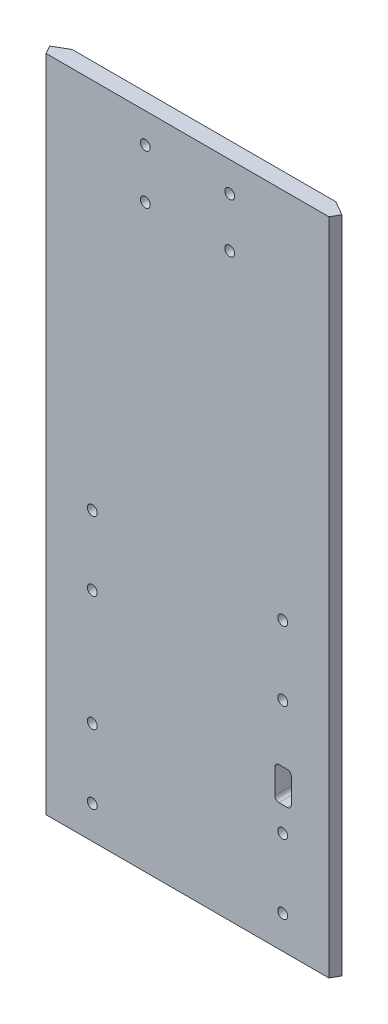
ISO-10303-21;
HEADER;
FILE_DESCRIPTION(('STEP AP214'),'2;1');
FILE_NAME('part.step','',(''),(''),'','','');
FILE_SCHEMA(('AUTOMOTIVE_DESIGN { 1 0 10303 214 1 1 1 1 }'));
ENDSEC;
DATA;
#1=APPLICATION_CONTEXT('core data for automotive mechanical design processes');
#2=APPLICATION_PROTOCOL_DEFINITION('international standard','automotive_design',2000,#1);
#3=PRODUCT_CONTEXT('',#1,'mechanical');
#4=PRODUCT('Part','Part','',(#3));
#5=PRODUCT_RELATED_PRODUCT_CATEGORY('part','',(#4));
#6=PRODUCT_DEFINITION_FORMATION('','',#4);
#7=PRODUCT_DEFINITION_CONTEXT('part definition',#1,'design');
#8=PRODUCT_DEFINITION('design','',#6,#7);
#9=PRODUCT_DEFINITION_SHAPE('','',#8);
#10=(LENGTH_UNIT() NAMED_UNIT(*) SI_UNIT(.MILLI.,.METRE.));
#11=(NAMED_UNIT(*) PLANE_ANGLE_UNIT() SI_UNIT($,.RADIAN.));
#12=(NAMED_UNIT(*) SI_UNIT($,.STERADIAN.) SOLID_ANGLE_UNIT());
#13=UNCERTAINTY_MEASURE_WITH_UNIT(LENGTH_MEASURE(1.E-05),#10,'distance_accuracy_value','');
#14=(GEOMETRIC_REPRESENTATION_CONTEXT(3) GLOBAL_UNCERTAINTY_ASSIGNED_CONTEXT((#13)) GLOBAL_UNIT_ASSIGNED_CONTEXT((#10,
#11,#12)) REPRESENTATION_CONTEXT('',''));
#15=CARTESIAN_POINT('',(0.,0.,0.));
#16=DIRECTION('',(0.,0.,1.));
#17=DIRECTION('',(1.,0.,0.));
#18=AXIS2_PLACEMENT_3D('',#15,#16,#17);
#19=CARTESIAN_POINT('',(-50.8,101.6,6.35));
#20=DIRECTION('',(0.,-1.,0.));
#21=DIRECTION('',(0.,0.,-1.));
#22=AXIS2_PLACEMENT_3D('',#19,#20,#21);
#23=PLANE('',#22);
#24=DIRECTION('',(-0.866025403784442,0.,0.499999999999994));
#25=VECTOR('',#24,1.);
#26=CARTESIAN_POINT('',(-50.8,101.6,0.));
#27=LINE('',#26,#25);
#28=CARTESIAN_POINT('',(-50.8,101.6,0.));
#29=VERTEX_POINT('',#28);
#30=CARTESIAN_POINT('',(-56.2992613140312,101.6,3.17499999999996));
#31=VERTEX_POINT('',#30);
#32=EDGE_CURVE('E331',#29,#31,#27,.T.);
#33=ORIENTED_EDGE('',*,*,#32,.T.);
#34=DIRECTION('',(-0.499999999999999,0.,-0.866025403784439));
#35=VECTOR('',#34,1.);
#36=CARTESIAN_POINT('',(-56.2992613140313,101.6,3.17499999999996));
#37=LINE('',#36,#35);
#38=CARTESIAN_POINT('',(-54.4661742093542,101.6,6.34999999999999));
#39=VERTEX_POINT('',#38);
#40=EDGE_CURVE('E148',#39,#31,#37,.T.);
#41=ORIENTED_EDGE('',*,*,#40,.F.);
#42=DIRECTION('',(-1.,0.,0.));
#43=VECTOR('',#42,1.);
#44=CARTESIAN_POINT('',(-50.8,101.6,6.35));
#45=LINE('',#44,#43);
#46=CARTESIAN_POINT('',(54.4661742093542,101.6,6.34999999999999));
#47=VERTEX_POINT('',#46);
#48=EDGE_CURVE('E157',#47,#39,#45,.T.);
#49=ORIENTED_EDGE('',*,*,#48,.F.);
#50=DIRECTION('',(-0.499999999999999,0.,0.866025403784439));
#51=VECTOR('',#50,1.);
#52=CARTESIAN_POINT('',(56.2992613140313,101.6,3.17499999999996));
#53=LINE('',#52,#51);
#54=CARTESIAN_POINT('',(56.2992613140313,101.6,3.17499999999996));
#55=VERTEX_POINT('',#54);
#56=EDGE_CURVE('E320',#55,#47,#53,.T.);
#57=ORIENTED_EDGE('',*,*,#56,.F.);
#58=DIRECTION('',(-0.866025403784442,0.,-0.499999999999995));
#59=VECTOR('',#58,1.);
#60=CARTESIAN_POINT('',(50.8,101.6,0.));
#61=LINE('',#60,#59);
#62=CARTESIAN_POINT('',(50.8,101.6,0.));
#63=VERTEX_POINT('',#62);
#64=EDGE_CURVE('E327',#55,#63,#61,.T.);
#65=ORIENTED_EDGE('',*,*,#64,.T.);
#66=DIRECTION('',(-1.,0.,0.));
#67=VECTOR('',#66,1.);
#68=CARTESIAN_POINT('',(-50.8,101.6,0.));
#69=LINE('',#68,#67);
#70=EDGE_CURVE('E174',#63,#29,#69,.T.);
#71=ORIENTED_EDGE('',*,*,#70,.T.);
#72=EDGE_LOOP('',(#33,#41,#49,#57,#65,#71));
#73=FACE_BOUND('',#72,.T.);
#74=ADVANCED_FACE('F37',(#73),#23,.F.);
#75=CARTESIAN_POINT('',(-50.8,-152.4,6.35));
#76=DIRECTION('',(0.,1.,0.));
#77=DIRECTION('',(0.,0.,1.));
#78=AXIS2_PLACEMENT_3D('',#75,#76,#77);
#79=PLANE('',#78);
#80=DIRECTION('',(1.,0.,0.));
#81=VECTOR('',#80,1.);
#82=CARTESIAN_POINT('',(-50.8,-152.4,6.35));
#83=LINE('',#82,#81);
#84=CARTESIAN_POINT('',(-54.4661742093542,-152.4,6.34999999999999));
#85=VERTEX_POINT('',#84);
#86=CARTESIAN_POINT('',(54.4661742093542,-152.4,6.34999999999999));
#87=VERTEX_POINT('',#86);
#88=EDGE_CURVE('E154',#85,#87,#83,.T.);
#89=ORIENTED_EDGE('',*,*,#88,.F.);
#90=DIRECTION('',(-0.499999999999999,0.,-0.866025403784439));
#91=VECTOR('',#90,1.);
#92=CARTESIAN_POINT('',(-56.2992613140313,-152.4,3.17499999999996));
#93=LINE('',#92,#91);
#94=CARTESIAN_POINT('',(-56.2992613140313,-152.4,3.17499999999996));
#95=VERTEX_POINT('',#94);
#96=EDGE_CURVE('E138',#85,#95,#93,.T.);
#97=ORIENTED_EDGE('',*,*,#96,.T.);
#98=DIRECTION('',(0.866025403784442,0.,-0.499999999999994));
#99=VECTOR('',#98,1.);
#100=CARTESIAN_POINT('',(-50.8,-152.4,0.));
#101=LINE('',#100,#99);
#102=CARTESIAN_POINT('',(-50.8,-152.4,0.));
#103=VERTEX_POINT('',#102);
#104=EDGE_CURVE('E175',#95,#103,#101,.T.);
#105=ORIENTED_EDGE('',*,*,#104,.T.);
#106=DIRECTION('',(1.,0.,0.));
#107=VECTOR('',#106,1.);
#108=CARTESIAN_POINT('',(-50.8,-152.4,0.));
#109=LINE('',#108,#107);
#110=CARTESIAN_POINT('',(50.8,-152.4,0.));
#111=VERTEX_POINT('',#110);
#112=EDGE_CURVE('E167',#103,#111,#109,.T.);
#113=ORIENTED_EDGE('',*,*,#112,.T.);
#114=DIRECTION('',(0.866025403784442,0.,0.499999999999995));
#115=VECTOR('',#114,1.);
#116=CARTESIAN_POINT('',(50.8,-152.4,0.));
#117=LINE('',#116,#115);
#118=CARTESIAN_POINT('',(56.2992613140312,-152.4,3.17499999999996));
#119=VERTEX_POINT('',#118);
#120=EDGE_CURVE('E329',#111,#119,#117,.T.);
#121=ORIENTED_EDGE('',*,*,#120,.T.);
#122=DIRECTION('',(-0.499999999999999,0.,0.866025403784439));
#123=VECTOR('',#122,1.);
#124=CARTESIAN_POINT('',(56.2992613140313,-152.4,3.17499999999996));
#125=LINE('',#124,#123);
#126=EDGE_CURVE('E162',#119,#87,#125,.T.);
#127=ORIENTED_EDGE('',*,*,#126,.T.);
#128=EDGE_LOOP('',(#89,#97,#105,#113,#121,#127));
#129=FACE_BOUND('',#128,.T.);
#130=ADVANCED_FACE('F160',(#129),#79,.F.);
#131=CARTESIAN_POINT('',(0.,0.,6.35));
#132=DIRECTION('',(0.,0.,1.));
#133=DIRECTION('',(1.,0.,0.));
#134=AXIS2_PLACEMENT_3D('',#131,#132,#133);
#135=PLANE('',#134);
#136=DIRECTION('',(-1.,0.,0.));
#137=VECTOR('',#136,1.);
#138=CARTESIAN_POINT('',(33.6381742093542,-90.8050000000001,6.35));
#139=LINE('',#138,#137);
#140=CARTESIAN_POINT('',(38.4006742093542,-90.805,6.35));
#141=VERTEX_POINT('',#140);
#142=CARTESIAN_POINT('',(35.2256742093542,-90.8050000000001,6.35));
#143=VERTEX_POINT('',#142);
#144=EDGE_CURVE('E213',#141,#143,#139,.T.);
#145=ORIENTED_EDGE('',*,*,#144,.F.);
#146=CARTESIAN_POINT('',(38.4006742093542,-92.3925000000001,6.35));
#147=DIRECTION('',(0.,0.,1.));
#148=DIRECTION('',(1.,0.,0.));
#149=AXIS2_PLACEMENT_3D('',#146,#147,#148);
#150=CIRCLE('',#149,1.5875);
#151=CARTESIAN_POINT('',(39.9881742093542,-92.3925000000001,6.35));
#152=VERTEX_POINT('',#151);
#153=EDGE_CURVE('E207',#141,#152,#150,.F.);
#154=ORIENTED_EDGE('',*,*,#153,.T.);
#155=DIRECTION('',(0.,1.,0.));
#156=VECTOR('',#155,1.);
#157=CARTESIAN_POINT('',(39.9881742093542,-103.505,6.35));
#158=LINE('',#157,#156);
#159=CARTESIAN_POINT('',(39.9881742093542,-101.9175,6.35));
#160=VERTEX_POINT('',#159);
#161=EDGE_CURVE('E237',#160,#152,#158,.T.);
#162=ORIENTED_EDGE('',*,*,#161,.F.);
#163=CARTESIAN_POINT('',(38.4006742093542,-101.9175,6.35));
#164=DIRECTION('',(0.,0.,1.));
#165=DIRECTION('',(1.,0.,0.));
#166=AXIS2_PLACEMENT_3D('',#163,#164,#165);
#167=CIRCLE('',#166,1.5875);
#168=CARTESIAN_POINT('',(38.4006742093542,-103.505,6.35));
#169=VERTEX_POINT('',#168);
#170=EDGE_CURVE('E199',#160,#169,#167,.F.);
#171=ORIENTED_EDGE('',*,*,#170,.T.);
#172=DIRECTION('',(1.,0.,0.));
#173=VECTOR('',#172,1.);
#174=CARTESIAN_POINT('',(33.6381742093542,-103.505,6.35));
#175=LINE('',#174,#173);
#176=CARTESIAN_POINT('',(35.2256742093542,-103.505,6.35));
#177=VERTEX_POINT('',#176);
#178=EDGE_CURVE('E243',#177,#169,#175,.T.);
#179=ORIENTED_EDGE('',*,*,#178,.F.);
#180=CARTESIAN_POINT('',(35.2256742093542,-101.9175,6.35));
#181=DIRECTION('',(0.,0.,1.));
#182=DIRECTION('',(1.,0.,0.));
#183=AXIS2_PLACEMENT_3D('',#180,#181,#182);
#184=CIRCLE('',#183,1.5875);
#185=CARTESIAN_POINT('',(33.6381742093542,-101.9175,6.35));
#186=VERTEX_POINT('',#185);
#187=EDGE_CURVE('E203',#177,#186,#184,.F.);
#188=ORIENTED_EDGE('',*,*,#187,.T.);
#189=DIRECTION('',(0.,-1.,0.));
#190=VECTOR('',#189,1.);
#191=CARTESIAN_POINT('',(33.6381742093542,-90.8050000000001,6.35));
#192=LINE('',#191,#190);
#193=CARTESIAN_POINT('',(33.6381742093542,-92.3925000000001,6.35));
#194=VERTEX_POINT('',#193);
#195=EDGE_CURVE('E215',#194,#186,#192,.T.);
#196=ORIENTED_EDGE('',*,*,#195,.F.);
#197=CARTESIAN_POINT('',(35.2256742093542,-92.3925000000001,6.35));
#198=DIRECTION('',(0.,0.,1.));
#199=DIRECTION('',(1.,0.,0.));
#200=AXIS2_PLACEMENT_3D('',#197,#198,#199);
#201=CIRCLE('',#200,1.5875);
#202=EDGE_CURVE('E45',#194,#143,#201,.F.);
#203=ORIENTED_EDGE('',*,*,#202,.T.);
#204=EDGE_LOOP('',(#145,#154,#162,#171,#179,#188,#196,#203));
#205=FACE_BOUND('',#204,.T.);
#206=CARTESIAN_POINT('',(-16.256,71.12,6.35));
#207=DIRECTION('',(0.,0.,1.));
#208=DIRECTION('',(1.,0.,0.));
#209=AXIS2_PLACEMENT_3D('',#206,#207,#208);
#210=CIRCLE('',#209,1.905);
#211=CARTESIAN_POINT('',(-14.351,71.12,6.35));
#212=VERTEX_POINT('',#211);
#213=EDGE_CURVE('E240',#212,#212,#210,.T.);
#214=ORIENTED_EDGE('',*,*,#213,.F.);
#215=EDGE_LOOP('',(#214));
#216=FACE_BOUND('',#215,.T.);
#217=CARTESIAN_POINT('',(16.256,71.12,6.35));
#218=DIRECTION('',(0.,0.,1.));
#219=DIRECTION('',(1.,0.,0.));
#220=AXIS2_PLACEMENT_3D('',#217,#218,#219);
#221=CIRCLE('',#220,1.905);
#222=CARTESIAN_POINT('',(18.161,71.12,6.35));
#223=VERTEX_POINT('',#222);
#224=EDGE_CURVE('E251',#223,#223,#221,.T.);
#225=ORIENTED_EDGE('',*,*,#224,.F.);
#226=EDGE_LOOP('',(#225));
#227=FACE_BOUND('',#226,.T.);
#228=CARTESIAN_POINT('',(16.256,90.17,6.35));
#229=DIRECTION('',(0.,0.,1.));
#230=DIRECTION('',(1.,0.,0.));
#231=AXIS2_PLACEMENT_3D('',#228,#229,#230);
#232=CIRCLE('',#231,1.905);
#233=CARTESIAN_POINT('',(18.161,90.17,6.35));
#234=VERTEX_POINT('',#233);
#235=EDGE_CURVE('E257',#234,#234,#232,.T.);
#236=ORIENTED_EDGE('',*,*,#235,.F.);
#237=EDGE_LOOP('',(#236));
#238=FACE_BOUND('',#237,.T.);
#239=CARTESIAN_POINT('',(-16.256,90.17,6.35));
#240=DIRECTION('',(0.,0.,1.));
#241=DIRECTION('',(1.,0.,0.));
#242=AXIS2_PLACEMENT_3D('',#239,#240,#241);
#243=CIRCLE('',#242,1.905);
#244=CARTESIAN_POINT('',(-14.351,90.17,6.35));
#245=VERTEX_POINT('',#244);
#246=EDGE_CURVE('E263',#245,#245,#243,.T.);
#247=ORIENTED_EDGE('',*,*,#246,.F.);
#248=EDGE_LOOP('',(#247));
#249=FACE_BOUND('',#248,.T.);
#250=CARTESIAN_POINT('',(-36.6861742093542,-68.58,6.35));
#251=DIRECTION('',(0.,0.,1.));
#252=DIRECTION('',(1.,0.,0.));
#253=AXIS2_PLACEMENT_3D('',#250,#251,#252);
#254=CIRCLE('',#253,1.905);
#255=CARTESIAN_POINT('',(-34.7811742093542,-68.58,6.35));
#256=VERTEX_POINT('',#255);
#257=EDGE_CURVE('E269',#256,#256,#254,.T.);
#258=ORIENTED_EDGE('',*,*,#257,.F.);
#259=EDGE_LOOP('',(#258));
#260=FACE_BOUND('',#259,.T.);
#261=CARTESIAN_POINT('',(-36.6861742093542,-113.03,6.35));
#262=DIRECTION('',(0.,0.,1.));
#263=DIRECTION('',(1.,0.,0.));
#264=AXIS2_PLACEMENT_3D('',#261,#262,#263);
#265=CIRCLE('',#264,1.905);
#266=CARTESIAN_POINT('',(-34.7811742093542,-113.03,6.35));
#267=VERTEX_POINT('',#266);
#268=EDGE_CURVE('E275',#267,#267,#265,.T.);
#269=ORIENTED_EDGE('',*,*,#268,.F.);
#270=EDGE_LOOP('',(#269));
#271=FACE_BOUND('',#270,.T.);
#272=CARTESIAN_POINT('',(-36.6861742093542,-139.7,6.35));
#273=DIRECTION('',(0.,0.,1.));
#274=DIRECTION('',(1.,0.,0.));
#275=AXIS2_PLACEMENT_3D('',#272,#273,#274);
#276=CIRCLE('',#275,1.905);
#277=CARTESIAN_POINT('',(-34.7811742093542,-139.7,6.35));
#278=VERTEX_POINT('',#277);
#279=EDGE_CURVE('E281',#278,#278,#276,.T.);
#280=ORIENTED_EDGE('',*,*,#279,.F.);
#281=EDGE_LOOP('',(#280));
#282=FACE_BOUND('',#281,.T.);
#283=CARTESIAN_POINT('',(36.6861742093542,-139.7,6.35));
#284=DIRECTION('',(0.,0.,1.));
#285=DIRECTION('',(1.,0.,0.));
#286=AXIS2_PLACEMENT_3D('',#283,#284,#285);
#287=CIRCLE('',#286,1.905);
#288=CARTESIAN_POINT('',(38.5911742093542,-139.7,6.35));
#289=VERTEX_POINT('',#288);
#290=EDGE_CURVE('E287',#289,#289,#287,.T.);
#291=ORIENTED_EDGE('',*,*,#290,.F.);
#292=EDGE_LOOP('',(#291));
#293=FACE_BOUND('',#292,.T.);
#294=CARTESIAN_POINT('',(36.6861742093542,-113.03,6.35));
#295=DIRECTION('',(0.,0.,1.));
#296=DIRECTION('',(1.,0.,0.));
#297=AXIS2_PLACEMENT_3D('',#294,#295,#296);
#298=CIRCLE('',#297,1.905);
#299=CARTESIAN_POINT('',(38.5911742093542,-113.03,6.35));
#300=VERTEX_POINT('',#299);
#301=EDGE_CURVE('E293',#300,#300,#298,.T.);
#302=ORIENTED_EDGE('',*,*,#301,.F.);
#303=EDGE_LOOP('',(#302));
#304=FACE_BOUND('',#303,.T.);
#305=CARTESIAN_POINT('',(36.6861742093542,-68.58,6.35));
#306=DIRECTION('',(0.,0.,1.));
#307=DIRECTION('',(1.,0.,0.));
#308=AXIS2_PLACEMENT_3D('',#305,#306,#307);
#309=CIRCLE('',#308,1.905);
#310=CARTESIAN_POINT('',(38.5911742093542,-68.58,6.35));
#311=VERTEX_POINT('',#310);
#312=EDGE_CURVE('E299',#311,#311,#309,.T.);
#313=ORIENTED_EDGE('',*,*,#312,.F.);
#314=EDGE_LOOP('',(#313));
#315=FACE_BOUND('',#314,.T.);
#316=CARTESIAN_POINT('',(36.6861742093542,-41.91,6.35));
#317=DIRECTION('',(0.,0.,1.));
#318=DIRECTION('',(1.,0.,0.));
#319=AXIS2_PLACEMENT_3D('',#316,#317,#318);
#320=CIRCLE('',#319,1.905);
#321=CARTESIAN_POINT('',(38.5911742093542,-41.91,6.35));
#322=VERTEX_POINT('',#321);
#323=EDGE_CURVE('E305',#322,#322,#320,.T.);
#324=ORIENTED_EDGE('',*,*,#323,.F.);
#325=EDGE_LOOP('',(#324));
#326=FACE_BOUND('',#325,.T.);
#327=CARTESIAN_POINT('',(-36.6861742093542,-41.91,6.35));
#328=DIRECTION('',(0.,0.,1.));
#329=DIRECTION('',(1.,0.,0.));
#330=AXIS2_PLACEMENT_3D('',#327,#328,#329);
#331=CIRCLE('',#330,1.905);
#332=CARTESIAN_POINT('',(-34.7811742093542,-41.91,6.35));
#333=VERTEX_POINT('',#332);
#334=EDGE_CURVE('E311',#333,#333,#331,.T.);
#335=ORIENTED_EDGE('',*,*,#334,.F.);
#336=EDGE_LOOP('',(#335));
#337=FACE_BOUND('',#336,.T.);
#338=DIRECTION('',(0.,1.,0.));
#339=VECTOR('',#338,1.);
#340=CARTESIAN_POINT('',(-54.4661742093542,-152.4,6.34999999999999));
#341=LINE('',#340,#339);
#342=EDGE_CURVE('E141',#85,#39,#341,.T.);
#343=ORIENTED_EDGE('',*,*,#342,.F.);
#344=ORIENTED_EDGE('',*,*,#88,.T.);
#345=DIRECTION('',(0.,1.,0.));
#346=VECTOR('',#345,1.);
#347=CARTESIAN_POINT('',(54.4661742093542,-152.4,6.34999999999999));
#348=LINE('',#347,#346);
#349=EDGE_CURVE('E325',#87,#47,#348,.T.);
#350=ORIENTED_EDGE('',*,*,#349,.T.);
#351=ORIENTED_EDGE('',*,*,#48,.T.);
#352=EDGE_LOOP('',(#343,#344,#350,#351));
#353=FACE_BOUND('',#352,.T.);
#354=ADVANCED_FACE('F152',(#205,#216,#227,#238,#249,#260,#271,#282,#293,#304,#315,#326,#337,
#353),#135,.T.);
#355=CARTESIAN_POINT('',(0.,0.,0.));
#356=DIRECTION('',(0.,0.,1.));
#357=DIRECTION('',(1.,0.,0.));
#358=AXIS2_PLACEMENT_3D('',#355,#356,#357);
#359=PLANE('',#358);
#360=DIRECTION('',(1.,0.,0.));
#361=VECTOR('',#360,1.);
#362=CARTESIAN_POINT('',(33.6381742093542,-103.505,0.));
#363=LINE('',#362,#361);
#364=CARTESIAN_POINT('',(35.2256742093542,-103.505,0.));
#365=VERTEX_POINT('',#364);
#366=CARTESIAN_POINT('',(38.4006742093542,-103.505,0.));
#367=VERTEX_POINT('',#366);
#368=EDGE_CURVE('E233',#365,#367,#363,.T.);
#369=ORIENTED_EDGE('',*,*,#368,.T.);
#370=CARTESIAN_POINT('',(38.4006742093542,-101.9175,0.));
#371=DIRECTION('',(0.,0.,1.));
#372=DIRECTION('',(1.,0.,0.));
#373=AXIS2_PLACEMENT_3D('',#370,#371,#372);
#374=CIRCLE('',#373,1.5875);
#375=CARTESIAN_POINT('',(39.9881742093542,-101.9175,0.));
#376=VERTEX_POINT('',#375);
#377=EDGE_CURVE('E201',#367,#376,#374,.T.);
#378=ORIENTED_EDGE('',*,*,#377,.T.);
#379=DIRECTION('',(0.,1.,0.));
#380=VECTOR('',#379,1.);
#381=CARTESIAN_POINT('',(39.9881742093542,-103.505,0.));
#382=LINE('',#381,#380);
#383=CARTESIAN_POINT('',(39.9881742093542,-92.3925000000001,0.));
#384=VERTEX_POINT('',#383);
#385=EDGE_CURVE('E235',#376,#384,#382,.T.);
#386=ORIENTED_EDGE('',*,*,#385,.T.);
#387=CARTESIAN_POINT('',(38.4006742093542,-92.3925000000001,0.));
#388=DIRECTION('',(0.,0.,1.));
#389=DIRECTION('',(1.,0.,0.));
#390=AXIS2_PLACEMENT_3D('',#387,#388,#389);
#391=CIRCLE('',#390,1.5875);
#392=CARTESIAN_POINT('',(38.4006742093542,-90.805,0.));
#393=VERTEX_POINT('',#392);
#394=EDGE_CURVE('E59',#384,#393,#391,.T.);
#395=ORIENTED_EDGE('',*,*,#394,.T.);
#396=DIRECTION('',(-1.,0.,0.));
#397=VECTOR('',#396,1.);
#398=CARTESIAN_POINT('',(33.6381742093542,-90.8050000000001,0.));
#399=LINE('',#398,#397);
#400=CARTESIAN_POINT('',(35.2256742093542,-90.8050000000001,0.));
#401=VERTEX_POINT('',#400);
#402=EDGE_CURVE('E229',#393,#401,#399,.T.);
#403=ORIENTED_EDGE('',*,*,#402,.T.);
#404=CARTESIAN_POINT('',(35.2256742093542,-92.3925000000001,0.));
#405=DIRECTION('',(0.,0.,1.));
#406=DIRECTION('',(1.,0.,0.));
#407=AXIS2_PLACEMENT_3D('',#404,#405,#406);
#408=CIRCLE('',#407,1.5875);
#409=CARTESIAN_POINT('',(33.6381742093542,-92.3925000000001,0.));
#410=VERTEX_POINT('',#409);
#411=EDGE_CURVE('E11',#401,#410,#408,.T.);
#412=ORIENTED_EDGE('',*,*,#411,.T.);
#413=DIRECTION('',(0.,-1.,0.));
#414=VECTOR('',#413,1.);
#415=CARTESIAN_POINT('',(33.6381742093542,-90.8050000000001,0.));
#416=LINE('',#415,#414);
#417=CARTESIAN_POINT('',(33.6381742093542,-101.9175,0.));
#418=VERTEX_POINT('',#417);
#419=EDGE_CURVE('E227',#410,#418,#416,.T.);
#420=ORIENTED_EDGE('',*,*,#419,.T.);
#421=CARTESIAN_POINT('',(35.2256742093542,-101.9175,0.));
#422=DIRECTION('',(0.,0.,1.));
#423=DIRECTION('',(1.,0.,0.));
#424=AXIS2_PLACEMENT_3D('',#421,#422,#423);
#425=CIRCLE('',#424,1.5875);
#426=EDGE_CURVE('E205',#418,#365,#425,.T.);
#427=ORIENTED_EDGE('',*,*,#426,.T.);
#428=EDGE_LOOP('',(#369,#378,#386,#395,#403,#412,#420,#427));
#429=FACE_BOUND('',#428,.T.);
#430=CARTESIAN_POINT('',(-16.256,71.12,0.));
#431=DIRECTION('',(0.,0.,1.));
#432=DIRECTION('',(1.,0.,0.));
#433=AXIS2_PLACEMENT_3D('',#430,#431,#432);
#434=CIRCLE('',#433,1.905);
#435=CARTESIAN_POINT('',(-14.351,71.12,0.));
#436=VERTEX_POINT('',#435);
#437=EDGE_CURVE('E248',#436,#436,#434,.T.);
#438=ORIENTED_EDGE('',*,*,#437,.T.);
#439=EDGE_LOOP('',(#438));
#440=FACE_BOUND('',#439,.T.);
#441=CARTESIAN_POINT('',(16.256,71.12,0.));
#442=DIRECTION('',(0.,0.,1.));
#443=DIRECTION('',(1.,0.,0.));
#444=AXIS2_PLACEMENT_3D('',#441,#442,#443);
#445=CIRCLE('',#444,1.905);
#446=CARTESIAN_POINT('',(18.161,71.12,0.));
#447=VERTEX_POINT('',#446);
#448=EDGE_CURVE('E254',#447,#447,#445,.T.);
#449=ORIENTED_EDGE('',*,*,#448,.T.);
#450=EDGE_LOOP('',(#449));
#451=FACE_BOUND('',#450,.T.);
#452=CARTESIAN_POINT('',(16.256,90.17,0.));
#453=DIRECTION('',(0.,0.,1.));
#454=DIRECTION('',(1.,0.,0.));
#455=AXIS2_PLACEMENT_3D('',#452,#453,#454);
#456=CIRCLE('',#455,1.905);
#457=CARTESIAN_POINT('',(18.161,90.17,0.));
#458=VERTEX_POINT('',#457);
#459=EDGE_CURVE('E260',#458,#458,#456,.T.);
#460=ORIENTED_EDGE('',*,*,#459,.T.);
#461=EDGE_LOOP('',(#460));
#462=FACE_BOUND('',#461,.T.);
#463=CARTESIAN_POINT('',(-16.256,90.17,0.));
#464=DIRECTION('',(0.,0.,1.));
#465=DIRECTION('',(1.,0.,0.));
#466=AXIS2_PLACEMENT_3D('',#463,#464,#465);
#467=CIRCLE('',#466,1.905);
#468=CARTESIAN_POINT('',(-14.351,90.17,0.));
#469=VERTEX_POINT('',#468);
#470=EDGE_CURVE('E266',#469,#469,#467,.T.);
#471=ORIENTED_EDGE('',*,*,#470,.T.);
#472=EDGE_LOOP('',(#471));
#473=FACE_BOUND('',#472,.T.);
#474=CARTESIAN_POINT('',(-36.6861742093542,-68.58,0.));
#475=DIRECTION('',(0.,0.,1.));
#476=DIRECTION('',(1.,0.,0.));
#477=AXIS2_PLACEMENT_3D('',#474,#475,#476);
#478=CIRCLE('',#477,1.905);
#479=CARTESIAN_POINT('',(-34.7811742093542,-68.58,0.));
#480=VERTEX_POINT('',#479);
#481=EDGE_CURVE('E272',#480,#480,#478,.T.);
#482=ORIENTED_EDGE('',*,*,#481,.T.);
#483=EDGE_LOOP('',(#482));
#484=FACE_BOUND('',#483,.T.);
#485=CARTESIAN_POINT('',(-36.6861742093542,-113.03,0.));
#486=DIRECTION('',(0.,0.,1.));
#487=DIRECTION('',(1.,0.,0.));
#488=AXIS2_PLACEMENT_3D('',#485,#486,#487);
#489=CIRCLE('',#488,1.905);
#490=CARTESIAN_POINT('',(-34.7811742093542,-113.03,0.));
#491=VERTEX_POINT('',#490);
#492=EDGE_CURVE('E278',#491,#491,#489,.T.);
#493=ORIENTED_EDGE('',*,*,#492,.T.);
#494=EDGE_LOOP('',(#493));
#495=FACE_BOUND('',#494,.T.);
#496=CARTESIAN_POINT('',(-36.6861742093542,-139.7,0.));
#497=DIRECTION('',(0.,0.,1.));
#498=DIRECTION('',(1.,0.,0.));
#499=AXIS2_PLACEMENT_3D('',#496,#497,#498);
#500=CIRCLE('',#499,1.905);
#501=CARTESIAN_POINT('',(-34.7811742093542,-139.7,0.));
#502=VERTEX_POINT('',#501);
#503=EDGE_CURVE('E284',#502,#502,#500,.T.);
#504=ORIENTED_EDGE('',*,*,#503,.T.);
#505=EDGE_LOOP('',(#504));
#506=FACE_BOUND('',#505,.T.);
#507=CARTESIAN_POINT('',(36.6861742093542,-139.7,0.));
#508=DIRECTION('',(0.,0.,1.));
#509=DIRECTION('',(1.,0.,0.));
#510=AXIS2_PLACEMENT_3D('',#507,#508,#509);
#511=CIRCLE('',#510,1.905);
#512=CARTESIAN_POINT('',(38.5911742093542,-139.7,0.));
#513=VERTEX_POINT('',#512);
#514=EDGE_CURVE('E290',#513,#513,#511,.T.);
#515=ORIENTED_EDGE('',*,*,#514,.T.);
#516=EDGE_LOOP('',(#515));
#517=FACE_BOUND('',#516,.T.);
#518=CARTESIAN_POINT('',(36.6861742093542,-113.03,0.));
#519=DIRECTION('',(0.,0.,1.));
#520=DIRECTION('',(1.,0.,0.));
#521=AXIS2_PLACEMENT_3D('',#518,#519,#520);
#522=CIRCLE('',#521,1.905);
#523=CARTESIAN_POINT('',(38.5911742093542,-113.03,0.));
#524=VERTEX_POINT('',#523);
#525=EDGE_CURVE('E296',#524,#524,#522,.T.);
#526=ORIENTED_EDGE('',*,*,#525,.T.);
#527=EDGE_LOOP('',(#526));
#528=FACE_BOUND('',#527,.T.);
#529=CARTESIAN_POINT('',(36.6861742093542,-68.58,0.));
#530=DIRECTION('',(0.,0.,1.));
#531=DIRECTION('',(1.,0.,0.));
#532=AXIS2_PLACEMENT_3D('',#529,#530,#531);
#533=CIRCLE('',#532,1.905);
#534=CARTESIAN_POINT('',(38.5911742093542,-68.58,0.));
#535=VERTEX_POINT('',#534);
#536=EDGE_CURVE('E302',#535,#535,#533,.T.);
#537=ORIENTED_EDGE('',*,*,#536,.T.);
#538=EDGE_LOOP('',(#537));
#539=FACE_BOUND('',#538,.T.);
#540=CARTESIAN_POINT('',(36.6861742093542,-41.91,0.));
#541=DIRECTION('',(0.,0.,1.));
#542=DIRECTION('',(1.,0.,0.));
#543=AXIS2_PLACEMENT_3D('',#540,#541,#542);
#544=CIRCLE('',#543,1.905);
#545=CARTESIAN_POINT('',(38.5911742093542,-41.91,0.));
#546=VERTEX_POINT('',#545);
#547=EDGE_CURVE('E308',#546,#546,#544,.T.);
#548=ORIENTED_EDGE('',*,*,#547,.T.);
#549=EDGE_LOOP('',(#548));
#550=FACE_BOUND('',#549,.T.);
#551=CARTESIAN_POINT('',(-36.6861742093542,-41.91,0.));
#552=DIRECTION('',(0.,0.,1.));
#553=DIRECTION('',(1.,0.,0.));
#554=AXIS2_PLACEMENT_3D('',#551,#552,#553);
#555=CIRCLE('',#554,1.905);
#556=CARTESIAN_POINT('',(-34.7811742093542,-41.91,0.));
#557=VERTEX_POINT('',#556);
#558=EDGE_CURVE('E314',#557,#557,#555,.T.);
#559=ORIENTED_EDGE('',*,*,#558,.T.);
#560=EDGE_LOOP('',(#559));
#561=FACE_BOUND('',#560,.T.);
#562=DIRECTION('',(0.,1.,0.));
#563=VECTOR('',#562,1.);
#564=CARTESIAN_POINT('',(50.8,101.6,0.));
#565=LINE('',#564,#563);
#566=EDGE_CURVE('E171',#111,#63,#565,.T.);
#567=ORIENTED_EDGE('',*,*,#566,.F.);
#568=ORIENTED_EDGE('',*,*,#112,.F.);
#569=DIRECTION('',(0.,-1.,0.));
#570=VECTOR('',#569,1.);
#571=CARTESIAN_POINT('',(-50.8,101.6,0.));
#572=LINE('',#571,#570);
#573=EDGE_CURVE('E178',#29,#103,#572,.T.);
#574=ORIENTED_EDGE('',*,*,#573,.F.);
#575=ORIENTED_EDGE('',*,*,#70,.F.);
#576=EDGE_LOOP('',(#567,#568,#574,#575));
#577=FACE_BOUND('',#576,.T.);
#578=ADVANCED_FACE('F225',(#429,#440,#451,#462,#473,#484,#495,#506,#517,#528,#539,#550,#561,
#577),#359,.F.);
#579=CARTESIAN_POINT('',(-50.8,-165.1,0.));
#580=DIRECTION('',(-0.499999999999994,0.,-0.866025403784442));
#581=DIRECTION('',(-0.866025403784442,0.,0.499999999999994));
#582=AXIS2_PLACEMENT_3D('',#579,#580,#581);
#583=PLANE('',#582);
#584=DIRECTION('',(0.,1.,0.));
#585=VECTOR('',#584,1.);
#586=CARTESIAN_POINT('',(-56.2992613140313,-152.4,3.17499999999996));
#587=LINE('',#586,#585);
#588=EDGE_CURVE('E144',#95,#31,#587,.T.);
#589=ORIENTED_EDGE('',*,*,#588,.T.);
#590=ORIENTED_EDGE('',*,*,#32,.F.);
#591=ORIENTED_EDGE('',*,*,#573,.T.);
#592=ORIENTED_EDGE('',*,*,#104,.F.);
#593=EDGE_LOOP('',(#589,#590,#591,#592));
#594=FACE_BOUND('',#593,.T.);
#595=ADVANCED_FACE('F340',(#594),#583,.T.);
#596=CARTESIAN_POINT('',(50.8,-165.1,0.));
#597=DIRECTION('',(0.499999999999995,0.,-0.866025403784442));
#598=DIRECTION('',(-0.866025403784442,0.,-0.499999999999995));
#599=AXIS2_PLACEMENT_3D('',#596,#597,#598);
#600=PLANE('',#599);
#601=DIRECTION('',(0.,1.,0.));
#602=VECTOR('',#601,1.);
#603=CARTESIAN_POINT('',(56.2992613140313,-152.4,3.17499999999996));
#604=LINE('',#603,#602);
#605=EDGE_CURVE('E323',#119,#55,#604,.T.);
#606=ORIENTED_EDGE('',*,*,#605,.F.);
#607=ORIENTED_EDGE('',*,*,#120,.F.);
#608=ORIENTED_EDGE('',*,*,#566,.T.);
#609=ORIENTED_EDGE('',*,*,#64,.F.);
#610=EDGE_LOOP('',(#606,#607,#608,#609));
#611=FACE_BOUND('',#610,.T.);
#612=ADVANCED_FACE('F346',(#611),#600,.T.);
#613=CARTESIAN_POINT('',(56.2992613140313,-152.4,3.17499999999996));
#614=DIRECTION('',(-0.866025403784439,0.,-0.499999999999999));
#615=DIRECTION('',(-0.499999999999999,0.,0.866025403784439));
#616=AXIS2_PLACEMENT_3D('',#613,#614,#615);
#617=PLANE('',#616);
#618=ORIENTED_EDGE('',*,*,#56,.T.);
#619=ORIENTED_EDGE('',*,*,#349,.F.);
#620=ORIENTED_EDGE('',*,*,#126,.F.);
#621=ORIENTED_EDGE('',*,*,#605,.T.);
#622=EDGE_LOOP('',(#618,#619,#620,#621));
#623=FACE_BOUND('',#622,.T.);
#624=ADVANCED_FACE('F348',(#623),#617,.F.);
#625=CARTESIAN_POINT('',(-56.2992613140313,-152.4,3.17499999999996));
#626=DIRECTION('',(0.866025403784439,0.,-0.499999999999999));
#627=DIRECTION('',(-0.499999999999999,0.,-0.866025403784439));
#628=AXIS2_PLACEMENT_3D('',#625,#626,#627);
#629=PLANE('',#628);
#630=ORIENTED_EDGE('',*,*,#40,.T.);
#631=ORIENTED_EDGE('',*,*,#588,.F.);
#632=ORIENTED_EDGE('',*,*,#96,.F.);
#633=ORIENTED_EDGE('',*,*,#342,.T.);
#634=EDGE_LOOP('',(#630,#631,#632,#633));
#635=FACE_BOUND('',#634,.T.);
#636=ADVANCED_FACE('F140',(#635),#629,.F.);
#637=CARTESIAN_POINT('',(-36.6861742093542,-41.91,0.));
#638=DIRECTION('',(0.,0.,1.));
#639=DIRECTION('',(1.,0.,0.));
#640=AXIS2_PLACEMENT_3D('',#637,#638,#639);
#641=CYLINDRICAL_SURFACE('',#640,1.905);
#642=ORIENTED_EDGE('',*,*,#558,.F.);
#643=EDGE_LOOP('',(#642));
#644=FACE_BOUND('',#643,.T.);
#645=ORIENTED_EDGE('',*,*,#334,.T.);
#646=EDGE_LOOP('',(#645));
#647=FACE_BOUND('',#646,.T.);
#648=ADVANCED_FACE('F355',(#644,#647),#641,.F.);
#649=CARTESIAN_POINT('',(36.6861742093542,-41.91,0.));
#650=DIRECTION('',(0.,0.,1.));
#651=DIRECTION('',(1.,0.,0.));
#652=AXIS2_PLACEMENT_3D('',#649,#650,#651);
#653=CYLINDRICAL_SURFACE('',#652,1.905);
#654=ORIENTED_EDGE('',*,*,#547,.F.);
#655=EDGE_LOOP('',(#654));
#656=FACE_BOUND('',#655,.T.);
#657=ORIENTED_EDGE('',*,*,#323,.T.);
#658=EDGE_LOOP('',(#657));
#659=FACE_BOUND('',#658,.T.);
#660=ADVANCED_FACE('F442',(#656,#659),#653,.F.);
#661=CARTESIAN_POINT('',(36.6861742093542,-68.58,0.));
#662=DIRECTION('',(0.,0.,1.));
#663=DIRECTION('',(1.,0.,0.));
#664=AXIS2_PLACEMENT_3D('',#661,#662,#663);
#665=CYLINDRICAL_SURFACE('',#664,1.905);
#666=ORIENTED_EDGE('',*,*,#536,.F.);
#667=EDGE_LOOP('',(#666));
#668=FACE_BOUND('',#667,.T.);
#669=ORIENTED_EDGE('',*,*,#312,.T.);
#670=EDGE_LOOP('',(#669));
#671=FACE_BOUND('',#670,.T.);
#672=ADVANCED_FACE('F438',(#668,#671),#665,.F.);
#673=CARTESIAN_POINT('',(36.6861742093542,-113.03,0.));
#674=DIRECTION('',(0.,0.,1.));
#675=DIRECTION('',(1.,0.,0.));
#676=AXIS2_PLACEMENT_3D('',#673,#674,#675);
#677=CYLINDRICAL_SURFACE('',#676,1.905);
#678=ORIENTED_EDGE('',*,*,#525,.F.);
#679=EDGE_LOOP('',(#678));
#680=FACE_BOUND('',#679,.T.);
#681=ORIENTED_EDGE('',*,*,#301,.T.);
#682=EDGE_LOOP('',(#681));
#683=FACE_BOUND('',#682,.T.);
#684=ADVANCED_FACE('F434',(#680,#683),#677,.F.);
#685=CARTESIAN_POINT('',(36.6861742093542,-139.7,0.));
#686=DIRECTION('',(0.,0.,1.));
#687=DIRECTION('',(1.,0.,0.));
#688=AXIS2_PLACEMENT_3D('',#685,#686,#687);
#689=CYLINDRICAL_SURFACE('',#688,1.905);
#690=ORIENTED_EDGE('',*,*,#514,.F.);
#691=EDGE_LOOP('',(#690));
#692=FACE_BOUND('',#691,.T.);
#693=ORIENTED_EDGE('',*,*,#290,.T.);
#694=EDGE_LOOP('',(#693));
#695=FACE_BOUND('',#694,.T.);
#696=ADVANCED_FACE('F430',(#692,#695),#689,.F.);
#697=CARTESIAN_POINT('',(-36.6861742093542,-139.7,0.));
#698=DIRECTION('',(0.,0.,1.));
#699=DIRECTION('',(1.,0.,0.));
#700=AXIS2_PLACEMENT_3D('',#697,#698,#699);
#701=CYLINDRICAL_SURFACE('',#700,1.905);
#702=ORIENTED_EDGE('',*,*,#503,.F.);
#703=EDGE_LOOP('',(#702));
#704=FACE_BOUND('',#703,.T.);
#705=ORIENTED_EDGE('',*,*,#279,.T.);
#706=EDGE_LOOP('',(#705));
#707=FACE_BOUND('',#706,.T.);
#708=ADVANCED_FACE('F426',(#704,#707),#701,.F.);
#709=CARTESIAN_POINT('',(-36.6861742093542,-113.03,0.));
#710=DIRECTION('',(0.,0.,1.));
#711=DIRECTION('',(1.,0.,0.));
#712=AXIS2_PLACEMENT_3D('',#709,#710,#711);
#713=CYLINDRICAL_SURFACE('',#712,1.905);
#714=ORIENTED_EDGE('',*,*,#492,.F.);
#715=EDGE_LOOP('',(#714));
#716=FACE_BOUND('',#715,.T.);
#717=ORIENTED_EDGE('',*,*,#268,.T.);
#718=EDGE_LOOP('',(#717));
#719=FACE_BOUND('',#718,.T.);
#720=ADVANCED_FACE('F422',(#716,#719),#713,.F.);
#721=CARTESIAN_POINT('',(-36.6861742093542,-68.58,0.));
#722=DIRECTION('',(0.,0.,1.));
#723=DIRECTION('',(1.,0.,0.));
#724=AXIS2_PLACEMENT_3D('',#721,#722,#723);
#725=CYLINDRICAL_SURFACE('',#724,1.905);
#726=ORIENTED_EDGE('',*,*,#481,.F.);
#727=EDGE_LOOP('',(#726));
#728=FACE_BOUND('',#727,.T.);
#729=ORIENTED_EDGE('',*,*,#257,.T.);
#730=EDGE_LOOP('',(#729));
#731=FACE_BOUND('',#730,.T.);
#732=ADVANCED_FACE('F418',(#728,#731),#725,.F.);
#733=CARTESIAN_POINT('',(-16.256,90.17,0.));
#734=DIRECTION('',(0.,0.,1.));
#735=DIRECTION('',(1.,0.,0.));
#736=AXIS2_PLACEMENT_3D('',#733,#734,#735);
#737=CYLINDRICAL_SURFACE('',#736,1.905);
#738=ORIENTED_EDGE('',*,*,#470,.F.);
#739=EDGE_LOOP('',(#738));
#740=FACE_BOUND('',#739,.T.);
#741=ORIENTED_EDGE('',*,*,#246,.T.);
#742=EDGE_LOOP('',(#741));
#743=FACE_BOUND('',#742,.T.);
#744=ADVANCED_FACE('F414',(#740,#743),#737,.F.);
#745=CARTESIAN_POINT('',(16.256,90.17,0.));
#746=DIRECTION('',(0.,0.,1.));
#747=DIRECTION('',(1.,0.,0.));
#748=AXIS2_PLACEMENT_3D('',#745,#746,#747);
#749=CYLINDRICAL_SURFACE('',#748,1.905);
#750=ORIENTED_EDGE('',*,*,#459,.F.);
#751=EDGE_LOOP('',(#750));
#752=FACE_BOUND('',#751,.T.);
#753=ORIENTED_EDGE('',*,*,#235,.T.);
#754=EDGE_LOOP('',(#753));
#755=FACE_BOUND('',#754,.T.);
#756=ADVANCED_FACE('F410',(#752,#755),#749,.F.);
#757=CARTESIAN_POINT('',(16.256,71.12,0.));
#758=DIRECTION('',(0.,0.,1.));
#759=DIRECTION('',(1.,0.,0.));
#760=AXIS2_PLACEMENT_3D('',#757,#758,#759);
#761=CYLINDRICAL_SURFACE('',#760,1.905);
#762=ORIENTED_EDGE('',*,*,#448,.F.);
#763=EDGE_LOOP('',(#762));
#764=FACE_BOUND('',#763,.T.);
#765=ORIENTED_EDGE('',*,*,#224,.T.);
#766=EDGE_LOOP('',(#765));
#767=FACE_BOUND('',#766,.T.);
#768=ADVANCED_FACE('F406',(#764,#767),#761,.F.);
#769=CARTESIAN_POINT('',(-16.256,71.12,0.));
#770=DIRECTION('',(0.,0.,1.));
#771=DIRECTION('',(1.,0.,0.));
#772=AXIS2_PLACEMENT_3D('',#769,#770,#771);
#773=CYLINDRICAL_SURFACE('',#772,1.905);
#774=ORIENTED_EDGE('',*,*,#437,.F.);
#775=EDGE_LOOP('',(#774));
#776=FACE_BOUND('',#775,.T.);
#777=ORIENTED_EDGE('',*,*,#213,.T.);
#778=EDGE_LOOP('',(#777));
#779=FACE_BOUND('',#778,.T.);
#780=ADVANCED_FACE('F403',(#776,#779),#773,.F.);
#781=CARTESIAN_POINT('',(33.6381742093542,-90.8050000000001,0.));
#782=DIRECTION('',(0.,1.,0.));
#783=DIRECTION('',(-1.,0.,0.));
#784=AXIS2_PLACEMENT_3D('',#781,#782,#783);
#785=PLANE('',#784);
#786=ORIENTED_EDGE('',*,*,#402,.F.);
#787=DIRECTION('',(0.,0.,1.));
#788=VECTOR('',#787,1.);
#789=CARTESIAN_POINT('',(38.4006742093542,-90.805,6.35));
#790=LINE('',#789,#788);
#791=EDGE_CURVE('E196',#393,#141,#790,.T.);
#792=ORIENTED_EDGE('',*,*,#791,.T.);
#793=ORIENTED_EDGE('',*,*,#144,.T.);
#794=DIRECTION('',(0.,0.,1.));
#795=VECTOR('',#794,1.);
#796=CARTESIAN_POINT('',(35.2256742093542,-90.8050000000001,0.));
#797=LINE('',#796,#795);
#798=EDGE_CURVE('E52',#143,#401,#797,.F.);
#799=ORIENTED_EDGE('',*,*,#798,.T.);
#800=EDGE_LOOP('',(#786,#792,#793,#799));
#801=FACE_BOUND('',#800,.T.);
#802=ADVANCED_FACE('F218',(#801),#785,.F.);
#803=CARTESIAN_POINT('',(39.9881742093542,-103.505,0.));
#804=DIRECTION('',(1.,0.,0.));
#805=DIRECTION('',(0.,0.,-1.));
#806=AXIS2_PLACEMENT_3D('',#803,#804,#805);
#807=PLANE('',#806);
#808=ORIENTED_EDGE('',*,*,#385,.F.);
#809=DIRECTION('',(0.,0.,1.));
#810=VECTOR('',#809,1.);
#811=CARTESIAN_POINT('',(39.9881742093542,-101.9175,6.35));
#812=LINE('',#811,#810);
#813=EDGE_CURVE('E165',#376,#160,#812,.T.);
#814=ORIENTED_EDGE('',*,*,#813,.T.);
#815=ORIENTED_EDGE('',*,*,#161,.T.);
#816=DIRECTION('',(0.,0.,1.));
#817=VECTOR('',#816,1.);
#818=CARTESIAN_POINT('',(39.9881742093542,-92.3925000000001,0.));
#819=LINE('',#818,#817);
#820=EDGE_CURVE('E163',#152,#384,#819,.F.);
#821=ORIENTED_EDGE('',*,*,#820,.T.);
#822=EDGE_LOOP('',(#808,#814,#815,#821));
#823=FACE_BOUND('',#822,.T.);
#824=ADVANCED_FACE('F383',(#823),#807,.F.);
#825=CARTESIAN_POINT('',(33.6381742093542,-103.505,0.));
#826=DIRECTION('',(0.,-1.,0.));
#827=DIRECTION('',(0.,0.,-1.));
#828=AXIS2_PLACEMENT_3D('',#825,#826,#827);
#829=PLANE('',#828);
#830=ORIENTED_EDGE('',*,*,#178,.T.);
#831=DIRECTION('',(0.,0.,1.));
#832=VECTOR('',#831,1.);
#833=CARTESIAN_POINT('',(38.4006742093542,-103.505,0.));
#834=LINE('',#833,#832);
#835=EDGE_CURVE('E188',#169,#367,#834,.F.);
#836=ORIENTED_EDGE('',*,*,#835,.T.);
#837=ORIENTED_EDGE('',*,*,#368,.F.);
#838=DIRECTION('',(0.,0.,1.));
#839=VECTOR('',#838,1.);
#840=CARTESIAN_POINT('',(35.2256742093542,-103.505,6.35));
#841=LINE('',#840,#839);
#842=EDGE_CURVE('E185',#365,#177,#841,.T.);
#843=ORIENTED_EDGE('',*,*,#842,.T.);
#844=EDGE_LOOP('',(#830,#836,#837,#843));
#845=FACE_BOUND('',#844,.T.);
#846=ADVANCED_FACE('F389',(#845),#829,.F.);
#847=CARTESIAN_POINT('',(33.6381742093542,-90.8050000000001,0.));
#848=DIRECTION('',(-1.,0.,0.));
#849=DIRECTION('',(0.,0.,1.));
#850=AXIS2_PLACEMENT_3D('',#847,#848,#849);
#851=PLANE('',#850);
#852=ORIENTED_EDGE('',*,*,#195,.T.);
#853=DIRECTION('',(0.,0.,1.));
#854=VECTOR('',#853,1.);
#855=CARTESIAN_POINT('',(33.6381742093542,-101.9175,0.));
#856=LINE('',#855,#854);
#857=EDGE_CURVE('E193',#186,#418,#856,.F.);
#858=ORIENTED_EDGE('',*,*,#857,.T.);
#859=ORIENTED_EDGE('',*,*,#419,.F.);
#860=DIRECTION('',(0.,0.,1.));
#861=VECTOR('',#860,1.);
#862=CARTESIAN_POINT('',(33.6381742093542,-92.3925000000001,6.35));
#863=LINE('',#862,#861);
#864=EDGE_CURVE('E190',#410,#194,#863,.T.);
#865=ORIENTED_EDGE('',*,*,#864,.T.);
#866=EDGE_LOOP('',(#852,#858,#859,#865));
#867=FACE_BOUND('',#866,.T.);
#868=ADVANCED_FACE('F231',(#867),#851,.F.);
#869=CARTESIAN_POINT('',(38.4006742093542,-101.9175,0.));
#870=DIRECTION('',(0.,0.,-1.));
#871=DIRECTION('',(-1.,0.,0.));
#872=AXIS2_PLACEMENT_3D('',#869,#870,#871);
#873=CYLINDRICAL_SURFACE('',#872,1.5875);
#874=ORIENTED_EDGE('',*,*,#377,.F.);
#875=ORIENTED_EDGE('',*,*,#835,.F.);
#876=ORIENTED_EDGE('',*,*,#170,.F.);
#877=ORIENTED_EDGE('',*,*,#813,.F.);
#878=EDGE_LOOP('',(#874,#875,#876,#877));
#879=FACE_BOUND('',#878,.T.);
#880=ADVANCED_FACE('F366',(#879),#873,.F.);
#881=CARTESIAN_POINT('',(35.2256742093542,-101.9175,0.));
#882=DIRECTION('',(0.,0.,-1.));
#883=DIRECTION('',(-1.,0.,0.));
#884=AXIS2_PLACEMENT_3D('',#881,#882,#883);
#885=CYLINDRICAL_SURFACE('',#884,1.5875);
#886=ORIENTED_EDGE('',*,*,#426,.F.);
#887=ORIENTED_EDGE('',*,*,#857,.F.);
#888=ORIENTED_EDGE('',*,*,#187,.F.);
#889=ORIENTED_EDGE('',*,*,#842,.F.);
#890=EDGE_LOOP('',(#886,#887,#888,#889));
#891=FACE_BOUND('',#890,.T.);
#892=ADVANCED_FACE('F369',(#891),#885,.F.);
#893=CARTESIAN_POINT('',(38.4006742093542,-92.3925000000001,0.));
#894=DIRECTION('',(0.,0.,-1.));
#895=DIRECTION('',(-1.,0.,0.));
#896=AXIS2_PLACEMENT_3D('',#893,#894,#895);
#897=CYLINDRICAL_SURFACE('',#896,1.5875);
#898=ORIENTED_EDGE('',*,*,#394,.F.);
#899=ORIENTED_EDGE('',*,*,#820,.F.);
#900=ORIENTED_EDGE('',*,*,#153,.F.);
#901=ORIENTED_EDGE('',*,*,#791,.F.);
#902=EDGE_LOOP('',(#898,#899,#900,#901));
#903=FACE_BOUND('',#902,.T.);
#904=ADVANCED_FACE('F372',(#903),#897,.F.);
#905=CARTESIAN_POINT('',(35.2256742093542,-92.3925000000001,0.));
#906=DIRECTION('',(0.,0.,-1.));
#907=DIRECTION('',(-1.,0.,0.));
#908=AXIS2_PLACEMENT_3D('',#905,#906,#907);
#909=CYLINDRICAL_SURFACE('',#908,1.5875);
#910=ORIENTED_EDGE('',*,*,#411,.F.);
#911=ORIENTED_EDGE('',*,*,#798,.F.);
#912=ORIENTED_EDGE('',*,*,#202,.F.);
#913=ORIENTED_EDGE('',*,*,#864,.F.);
#914=EDGE_LOOP('',(#910,#911,#912,#913));
#915=FACE_BOUND('',#914,.T.);
#916=ADVANCED_FACE('F39',(#915),#909,.F.);
#917=CLOSED_SHELL('',(#74,#130,#354,#578,#595,#612,#624,#636,#648,#660,#672,#684,#696,#708,#720,
#732,#744,#756,#768,#780,#802,#824,#846,#868,#880,#892,#904,#916));
#918=MANIFOLD_SOLID_BREP('B2',#917);
#919=ADVANCED_BREP_SHAPE_REPRESENTATION('',(#18,#918),#14);
#920=SHAPE_DEFINITION_REPRESENTATION(#9,#919);
ENDSEC;
END-ISO-10303-21;
